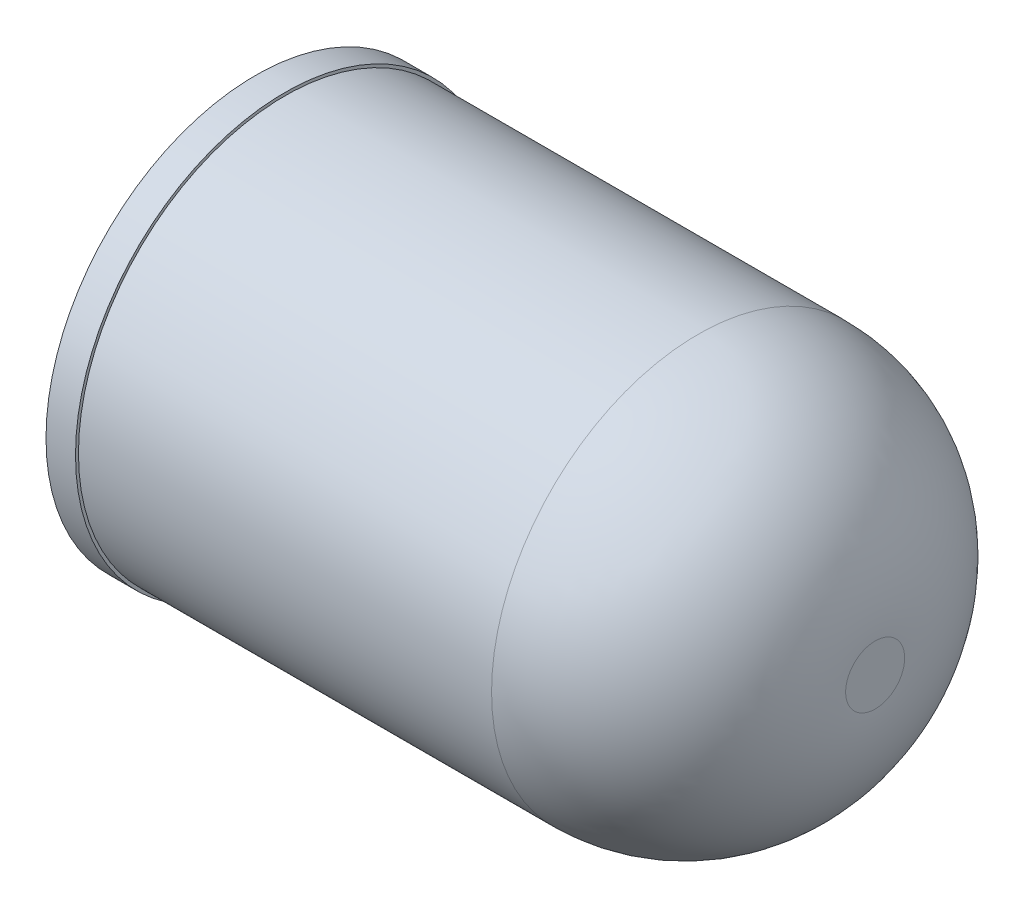
ISO-10303-21;
HEADER;
FILE_DESCRIPTION(('STEP AP214'),'2;1');
FILE_NAME('part.step','',(''),(''),'','','');
FILE_SCHEMA(('AUTOMOTIVE_DESIGN { 1 0 10303 214 1 1 1 1 }'));
ENDSEC;
DATA;
#1=APPLICATION_CONTEXT('core data for automotive mechanical design processes');
#2=APPLICATION_PROTOCOL_DEFINITION('international standard','automotive_design',2000,#1);
#3=PRODUCT_CONTEXT('',#1,'mechanical');
#4=PRODUCT('Part','Part','',(#3));
#5=PRODUCT_RELATED_PRODUCT_CATEGORY('part','',(#4));
#6=PRODUCT_DEFINITION_FORMATION('','',#4);
#7=PRODUCT_DEFINITION_CONTEXT('part definition',#1,'design');
#8=PRODUCT_DEFINITION('design','',#6,#7);
#9=PRODUCT_DEFINITION_SHAPE('','',#8);
#10=(LENGTH_UNIT() NAMED_UNIT(*) SI_UNIT(.MILLI.,.METRE.));
#11=(NAMED_UNIT(*) PLANE_ANGLE_UNIT() SI_UNIT($,.RADIAN.));
#12=(NAMED_UNIT(*) SI_UNIT($,.STERADIAN.) SOLID_ANGLE_UNIT());
#13=UNCERTAINTY_MEASURE_WITH_UNIT(LENGTH_MEASURE(1.E-05),#10,'distance_accuracy_value','');
#14=(GEOMETRIC_REPRESENTATION_CONTEXT(3) GLOBAL_UNCERTAINTY_ASSIGNED_CONTEXT((#13)) GLOBAL_UNIT_ASSIGNED_CONTEXT((#10,
#11,#12)) REPRESENTATION_CONTEXT('',''));
#15=CARTESIAN_POINT('',(0.,0.,0.));
#16=DIRECTION('',(0.,0.,1.));
#17=DIRECTION('',(1.,0.,0.));
#18=AXIS2_PLACEMENT_3D('',#15,#16,#17);
#19=CARTESIAN_POINT('',(10.,0.,0.));
#20=DIRECTION('',(-1.,0.,0.));
#21=DIRECTION('',(0.,0.,1.));
#22=AXIS2_PLACEMENT_3D('',#19,#20,#21);
#23=CYLINDRICAL_SURFACE('',#22,3.5);
#24=CARTESIAN_POINT('',(7.,0.,0.));
#25=DIRECTION('',(1.,0.,0.));
#26=DIRECTION('',(0.,0.,-1.));
#27=AXIS2_PLACEMENT_3D('',#24,#25,#26);
#28=CIRCLE('',#27,3.5);
#29=CARTESIAN_POINT('',(7.,0.,-3.5));
#30=VERTEX_POINT('',#29);
#31=EDGE_CURVE('E10',#30,#30,#28,.F.);
#32=ORIENTED_EDGE('',*,*,#31,.T.);
#33=EDGE_LOOP('',(#32));
#34=FACE_BOUND('',#33,.T.);
#35=CARTESIAN_POINT('',(0.,0.,0.));
#36=DIRECTION('',(1.,0.,0.));
#37=DIRECTION('',(0.,0.,-1.));
#38=AXIS2_PLACEMENT_3D('',#35,#36,#37);
#39=CIRCLE('',#38,3.5);
#40=CARTESIAN_POINT('',(0.,0.,-3.5));
#41=VERTEX_POINT('',#40);
#42=EDGE_CURVE('E45',#41,#41,#39,.T.);
#43=ORIENTED_EDGE('',*,*,#42,.T.);
#44=EDGE_LOOP('',(#43));
#45=FACE_BOUND('',#44,.T.);
#46=ADVANCED_FACE('F34',(#34,#45),#23,.T.);
#47=CARTESIAN_POINT('',(10.,0.,0.));
#48=DIRECTION('',(1.,0.,0.));
#49=DIRECTION('',(0.,0.,-1.));
#50=AXIS2_PLACEMENT_3D('',#47,#48,#49);
#51=PLANE('',#50);
#52=CARTESIAN_POINT('',(10.,0.,0.));
#53=DIRECTION('',(1.,0.,0.));
#54=DIRECTION('',(0.,0.,-1.));
#55=AXIS2_PLACEMENT_3D('',#52,#53,#54);
#56=CIRCLE('',#55,0.500000000000003);
#57=CARTESIAN_POINT('',(10.,0.,-0.500000000000003));
#58=VERTEX_POINT('',#57);
#59=EDGE_CURVE('E41',#58,#58,#56,.T.);
#60=ORIENTED_EDGE('',*,*,#59,.T.);
#61=EDGE_LOOP('',(#60));
#62=FACE_BOUND('',#61,.T.);
#63=ADVANCED_FACE('F76',(#62),#51,.T.);
#64=CARTESIAN_POINT('',(7.,0.,0.));
#65=DIRECTION('',(1.,0.,0.));
#66=DIRECTION('',(0.,0.,-1.));
#67=AXIS2_PLACEMENT_3D('',#64,#65,#66);
#68=DEGENERATE_TOROIDAL_SURFACE('',#67,0.500000000000003,3.,.T.);
#69=ORIENTED_EDGE('',*,*,#31,.F.);
#70=EDGE_LOOP('',(#69));
#71=FACE_BOUND('',#70,.T.);
#72=ORIENTED_EDGE('',*,*,#59,.F.);
#73=EDGE_LOOP('',(#72));
#74=FACE_BOUND('',#73,.T.);
#75=ADVANCED_FACE('F36',(#71,#74),#68,.T.);
#76=CARTESIAN_POINT('',(-0.5,0.,0.));
#77=DIRECTION('',(1.,0.,0.));
#78=DIRECTION('',(0.,0.,-1.));
#79=AXIS2_PLACEMENT_3D('',#76,#77,#78);
#80=CYLINDRICAL_SURFACE('',#79,3.55);
#81=CARTESIAN_POINT('',(-0.5,0.,0.));
#82=DIRECTION('',(-1.,0.,0.));
#83=DIRECTION('',(0.,0.,1.));
#84=AXIS2_PLACEMENT_3D('',#81,#82,#83);
#85=CIRCLE('',#84,3.55);
#86=CARTESIAN_POINT('',(-0.5,0.,3.55));
#87=VERTEX_POINT('',#86);
#88=EDGE_CURVE('E49',#87,#87,#85,.T.);
#89=ORIENTED_EDGE('',*,*,#88,.F.);
#90=EDGE_LOOP('',(#89));
#91=FACE_BOUND('',#90,.T.);
#92=CARTESIAN_POINT('',(0.,0.,0.));
#93=DIRECTION('',(-1.,0.,0.));
#94=DIRECTION('',(0.,0.,1.));
#95=AXIS2_PLACEMENT_3D('',#92,#93,#94);
#96=CIRCLE('',#95,3.55);
#97=CARTESIAN_POINT('',(0.,0.,3.55));
#98=VERTEX_POINT('',#97);
#99=EDGE_CURVE('E52',#98,#98,#96,.T.);
#100=ORIENTED_EDGE('',*,*,#99,.T.);
#101=EDGE_LOOP('',(#100));
#102=FACE_BOUND('',#101,.T.);
#103=ADVANCED_FACE('F60',(#91,#102),#80,.T.);
#104=CARTESIAN_POINT('',(-0.5,0.,0.));
#105=DIRECTION('',(-1.,0.,0.));
#106=DIRECTION('',(0.,0.,1.));
#107=AXIS2_PLACEMENT_3D('',#104,#105,#106);
#108=PLANE('',#107);
#109=ORIENTED_EDGE('',*,*,#88,.T.);
#110=EDGE_LOOP('',(#109));
#111=FACE_BOUND('',#110,.T.);
#112=ADVANCED_FACE('F58',(#111),#108,.T.);
#113=CARTESIAN_POINT('',(0.,0.,0.));
#114=DIRECTION('',(-1.,0.,0.));
#115=DIRECTION('',(0.,0.,1.));
#116=AXIS2_PLACEMENT_3D('',#113,#114,#115);
#117=PLANE('',#116);
#118=ORIENTED_EDGE('',*,*,#42,.F.);
#119=EDGE_LOOP('',(#118));
#120=FACE_BOUND('',#119,.T.);
#121=ORIENTED_EDGE('',*,*,#99,.F.);
#122=EDGE_LOOP('',(#121));
#123=FACE_BOUND('',#122,.T.);
#124=ADVANCED_FACE('F66',(#120,#123),#117,.F.);
#125=CLOSED_SHELL('',(#46,#63,#75,#103,#112,#124));
#126=MANIFOLD_SOLID_BREP('B2',#125);
#127=ADVANCED_BREP_SHAPE_REPRESENTATION('',(#18,#126),#14);
#128=SHAPE_DEFINITION_REPRESENTATION(#9,#127);
ENDSEC;
END-ISO-10303-21;
